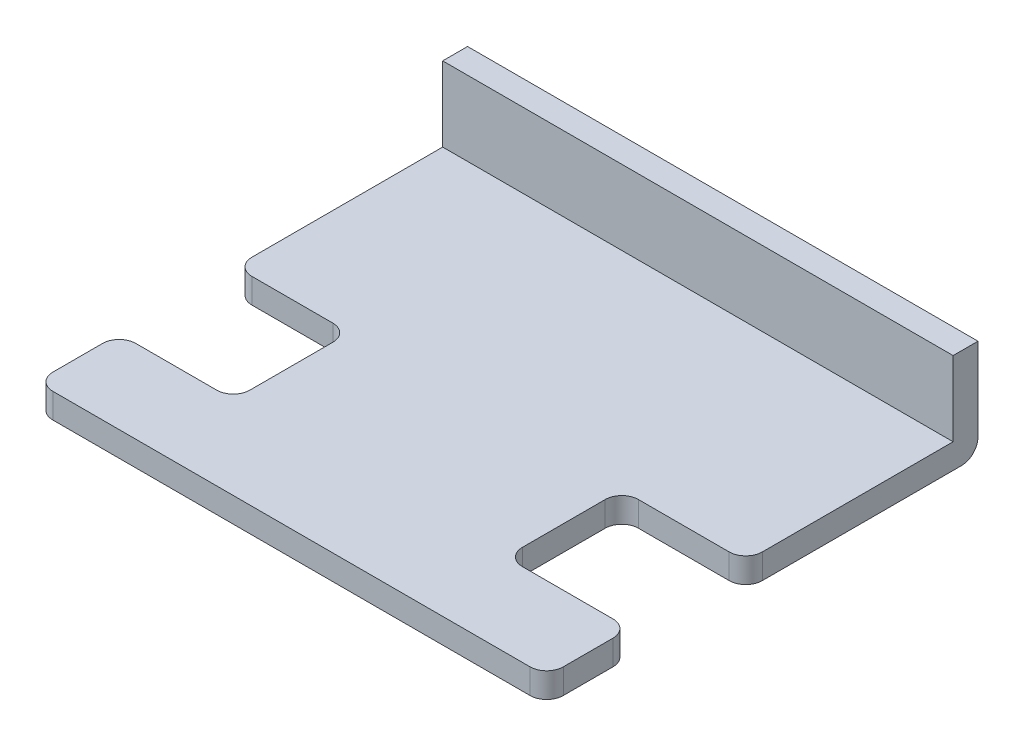
ISO-10303-21;
HEADER;
FILE_DESCRIPTION(('STEP AP214'),'2;1');
FILE_NAME('part.step','',(''),(''),'','','');
FILE_SCHEMA(('AUTOMOTIVE_DESIGN { 1 0 10303 214 1 1 1 1 }'));
ENDSEC;
DATA;
#1=APPLICATION_CONTEXT('core data for automotive mechanical design processes');
#2=APPLICATION_PROTOCOL_DEFINITION('international standard','automotive_design',2000,#1);
#3=PRODUCT_CONTEXT('',#1,'mechanical');
#4=PRODUCT('Part','Part','',(#3));
#5=PRODUCT_RELATED_PRODUCT_CATEGORY('part','',(#4));
#6=PRODUCT_DEFINITION_FORMATION('','',#4);
#7=PRODUCT_DEFINITION_CONTEXT('part definition',#1,'design');
#8=PRODUCT_DEFINITION('design','',#6,#7);
#9=PRODUCT_DEFINITION_SHAPE('','',#8);
#10=(LENGTH_UNIT() NAMED_UNIT(*) SI_UNIT(.MILLI.,.METRE.));
#11=(NAMED_UNIT(*) PLANE_ANGLE_UNIT() SI_UNIT($,.RADIAN.));
#12=(NAMED_UNIT(*) SI_UNIT($,.STERADIAN.) SOLID_ANGLE_UNIT());
#13=UNCERTAINTY_MEASURE_WITH_UNIT(LENGTH_MEASURE(1.E-05),#10,'distance_accuracy_value','');
#14=(GEOMETRIC_REPRESENTATION_CONTEXT(3) GLOBAL_UNCERTAINTY_ASSIGNED_CONTEXT((#13)) GLOBAL_UNIT_ASSIGNED_CONTEXT((#10,
#11,#12)) REPRESENTATION_CONTEXT('',''));
#15=CARTESIAN_POINT('',(0.,0.,0.));
#16=DIRECTION('',(0.,0.,1.));
#17=DIRECTION('',(1.,0.,0.));
#18=AXIS2_PLACEMENT_3D('',#15,#16,#17);
#19=CARTESIAN_POINT('',(0.,2.,-6.21301775147929));
#20=DIRECTION('',(-1.,0.,0.));
#21=DIRECTION('',(0.,0.,1.));
#22=AXIS2_PLACEMENT_3D('',#19,#20,#21);
#23=CYLINDRICAL_SURFACE('',#22,2.);
#24=DIRECTION('',(-1.,0.,0.));
#25=VECTOR('',#24,1.);
#26=CARTESIAN_POINT('',(0.,2.,-8.21301775147929));
#27=LINE('',#26,#25);
#28=CARTESIAN_POINT('',(31.0650887573964,2.,-8.21301775147929));
#29=VERTEX_POINT('',#28);
#30=CARTESIAN_POINT('',(-30.4733727810651,2.,-8.21301775147929));
#31=VERTEX_POINT('',#30);
#32=EDGE_CURVE('E202',#29,#31,#27,.T.);
#33=ORIENTED_EDGE('',*,*,#32,.F.);
#34=CARTESIAN_POINT('',(31.0650887573964,2.,-6.21301775147929));
#35=DIRECTION('',(-1.,0.,0.));
#36=DIRECTION('',(0.,0.,1.));
#37=AXIS2_PLACEMENT_3D('',#34,#35,#36);
#38=CIRCLE('',#37,2.);
#39=CARTESIAN_POINT('',(31.0650887573964,0.,-6.21301775147929));
#40=VERTEX_POINT('',#39);
#41=EDGE_CURVE('E40',#40,#29,#38,.F.);
#42=ORIENTED_EDGE('',*,*,#41,.F.);
#43=DIRECTION('',(-1.,0.,0.));
#44=VECTOR('',#43,1.);
#45=CARTESIAN_POINT('',(-28.4733727810651,0.,-6.21301775147929));
#46=LINE('',#45,#44);
#47=CARTESIAN_POINT('',(-30.4733727810651,0.,-6.21301775147929));
#48=VERTEX_POINT('',#47);
#49=EDGE_CURVE('E293',#48,#40,#46,.F.);
#50=ORIENTED_EDGE('',*,*,#49,.F.);
#51=CARTESIAN_POINT('',(-30.4733727810651,2.,-6.21301775147929));
#52=DIRECTION('',(1.,0.,0.));
#53=DIRECTION('',(0.,0.,-1.));
#54=AXIS2_PLACEMENT_3D('',#51,#52,#53);
#55=CIRCLE('',#54,2.);
#56=EDGE_CURVE('E11',#31,#48,#55,.F.);
#57=ORIENTED_EDGE('',*,*,#56,.F.);
#58=EDGE_LOOP('',(#33,#42,#50,#57));
#59=FACE_BOUND('',#58,.T.);
#60=ADVANCED_FACE('F33',(#59),#23,.T.);
#61=CARTESIAN_POINT('',(-30.4733727810651,3.,-5.21301775147929));
#62=DIRECTION('',(1.,0.,0.));
#63=DIRECTION('',(0.,0.,-1.));
#64=AXIS2_PLACEMENT_3D('',#61,#62,#63);
#65=PLANE('',#64);
#66=DIRECTION('',(0.,1.,0.));
#67=VECTOR('',#66,1.);
#68=CARTESIAN_POINT('',(-30.4733727810651,0.,-8.21301775147929));
#69=LINE('',#68,#67);
#70=CARTESIAN_POINT('',(-30.4733727810651,12.,-8.21301775147929));
#71=VERTEX_POINT('',#70);
#72=EDGE_CURVE('E195',#31,#71,#69,.T.);
#73=ORIENTED_EDGE('',*,*,#72,.F.);
#74=ORIENTED_EDGE('',*,*,#56,.T.);
#75=DIRECTION('',(0.,0.,1.));
#76=VECTOR('',#75,1.);
#77=CARTESIAN_POINT('',(-30.4733727810651,0.,-5.21301775147929));
#78=LINE('',#77,#76);
#79=CARTESIAN_POINT('',(-30.4733727810651,0.,17.7869822485207));
#80=VERTEX_POINT('',#79);
#81=EDGE_CURVE('E212',#48,#80,#78,.T.);
#82=ORIENTED_EDGE('',*,*,#81,.T.);
#83=DIRECTION('',(0.,-1.,0.));
#84=VECTOR('',#83,1.);
#85=CARTESIAN_POINT('',(-30.4733727810651,3.,17.7869822485207));
#86=LINE('',#85,#84);
#87=CARTESIAN_POINT('',(-30.4733727810651,3.,17.7869822485207));
#88=VERTEX_POINT('',#87);
#89=EDGE_CURVE('E281',#88,#80,#86,.T.);
#90=ORIENTED_EDGE('',*,*,#89,.F.);
#91=DIRECTION('',(0.,0.,1.));
#92=VECTOR('',#91,1.);
#93=CARTESIAN_POINT('',(-30.4733727810651,3.,-5.21301775147929));
#94=LINE('',#93,#92);
#95=CARTESIAN_POINT('',(-30.4733727810651,3.,-5.21301775147929));
#96=VERTEX_POINT('',#95);
#97=EDGE_CURVE('E235',#96,#88,#94,.T.);
#98=ORIENTED_EDGE('',*,*,#97,.F.);
#99=DIRECTION('',(0.,1.,0.));
#100=VECTOR('',#99,1.);
#101=CARTESIAN_POINT('',(-30.4733727810651,0.,-5.21301775147929));
#102=LINE('',#101,#100);
#103=CARTESIAN_POINT('',(-30.4733727810651,12.,-5.21301775147929));
#104=VERTEX_POINT('',#103);
#105=EDGE_CURVE('E209',#96,#104,#102,.T.);
#106=ORIENTED_EDGE('',*,*,#105,.T.);
#107=DIRECTION('',(0.,0.,1.));
#108=VECTOR('',#107,1.);
#109=CARTESIAN_POINT('',(-30.4733727810651,12.,-8.21301775147929));
#110=LINE('',#109,#108);
#111=EDGE_CURVE('E206',#71,#104,#110,.T.);
#112=ORIENTED_EDGE('',*,*,#111,.F.);
#113=EDGE_LOOP('',(#73,#74,#82,#90,#98,#106,#112));
#114=FACE_BOUND('',#113,.T.);
#115=ADVANCED_FACE('F207',(#114),#65,.F.);
#116=CARTESIAN_POINT('',(-28.4733727810651,3.,17.7869822485207));
#117=DIRECTION('',(0.,-1.,0.));
#118=DIRECTION('',(0.,0.,-1.));
#119=AXIS2_PLACEMENT_3D('',#116,#117,#118);
#120=CYLINDRICAL_SURFACE('',#119,2.);
#121=CARTESIAN_POINT('',(-28.4733727810651,0.,17.7869822485207));
#122=DIRECTION('',(0.,1.,0.));
#123=DIRECTION('',(0.,0.,1.));
#124=AXIS2_PLACEMENT_3D('',#121,#122,#123);
#125=CIRCLE('',#124,2.);
#126=CARTESIAN_POINT('',(-28.4733727810651,0.,19.7869822485207));
#127=VERTEX_POINT('',#126);
#128=EDGE_CURVE('E405',#80,#127,#125,.T.);
#129=ORIENTED_EDGE('',*,*,#128,.T.);
#130=DIRECTION('',(0.,-1.,0.));
#131=VECTOR('',#130,1.);
#132=CARTESIAN_POINT('',(-28.4733727810651,3.,19.7869822485207));
#133=LINE('',#132,#131);
#134=CARTESIAN_POINT('',(-28.4733727810651,3.,19.7869822485207));
#135=VERTEX_POINT('',#134);
#136=EDGE_CURVE('E310',#135,#127,#133,.T.);
#137=ORIENTED_EDGE('',*,*,#136,.F.);
#138=CARTESIAN_POINT('',(-28.4733727810651,3.,17.7869822485207));
#139=DIRECTION('',(0.,1.,0.));
#140=DIRECTION('',(0.,0.,1.));
#141=AXIS2_PLACEMENT_3D('',#138,#139,#140);
#142=CIRCLE('',#141,2.);
#143=EDGE_CURVE('E232',#88,#135,#142,.T.);
#144=ORIENTED_EDGE('',*,*,#143,.F.);
#145=ORIENTED_EDGE('',*,*,#89,.T.);
#146=EDGE_LOOP('',(#129,#137,#144,#145));
#147=FACE_BOUND('',#146,.T.);
#148=ADVANCED_FACE('F406',(#147),#120,.T.);
#149=CARTESIAN_POINT('',(-28.4733727810651,3.,19.7869822485207));
#150=DIRECTION('',(0.,0.,-1.));
#151=DIRECTION('',(-1.,0.,0.));
#152=AXIS2_PLACEMENT_3D('',#149,#150,#151);
#153=PLANE('',#152);
#154=DIRECTION('',(1.,0.,0.));
#155=VECTOR('',#154,1.);
#156=CARTESIAN_POINT('',(-28.4733727810651,0.,19.7869822485207));
#157=LINE('',#156,#155);
#158=CARTESIAN_POINT('',(-18.715976331361,0.,19.7869822485207));
#159=VERTEX_POINT('',#158);
#160=EDGE_CURVE('E404',#127,#159,#157,.T.);
#161=ORIENTED_EDGE('',*,*,#160,.T.);
#162=DIRECTION('',(0.,-1.,0.));
#163=VECTOR('',#162,1.);
#164=CARTESIAN_POINT('',(-18.715976331361,3.,19.7869822485207));
#165=LINE('',#164,#163);
#166=CARTESIAN_POINT('',(-18.715976331361,3.,19.7869822485207));
#167=VERTEX_POINT('',#166);
#168=EDGE_CURVE('E312',#167,#159,#165,.T.);
#169=ORIENTED_EDGE('',*,*,#168,.F.);
#170=DIRECTION('',(1.,0.,0.));
#171=VECTOR('',#170,1.);
#172=CARTESIAN_POINT('',(-28.4733727810651,3.,19.7869822485207));
#173=LINE('',#172,#171);
#174=EDGE_CURVE('E234',#135,#167,#173,.T.);
#175=ORIENTED_EDGE('',*,*,#174,.F.);
#176=ORIENTED_EDGE('',*,*,#136,.T.);
#177=EDGE_LOOP('',(#161,#169,#175,#176));
#178=FACE_BOUND('',#177,.T.);
#179=ADVANCED_FACE('F412',(#178),#153,.F.);
#180=CARTESIAN_POINT('',(-18.715976331361,3.,21.7869822485207));
#181=DIRECTION('',(0.,-1.,0.));
#182=DIRECTION('',(0.,0.,-1.));
#183=AXIS2_PLACEMENT_3D('',#180,#181,#182);
#184=CYLINDRICAL_SURFACE('',#183,2.);
#185=CARTESIAN_POINT('',(-18.715976331361,0.,21.7869822485207));
#186=DIRECTION('',(0.,-1.,0.));
#187=DIRECTION('',(0.,0.,1.));
#188=AXIS2_PLACEMENT_3D('',#185,#186,#187);
#189=CIRCLE('',#188,2.);
#190=CARTESIAN_POINT('',(-16.715976331361,0.,21.7869822485207));
#191=VERTEX_POINT('',#190);
#192=EDGE_CURVE('E402',#159,#191,#189,.T.);
#193=ORIENTED_EDGE('',*,*,#192,.T.);
#194=DIRECTION('',(0.,-1.,0.));
#195=VECTOR('',#194,1.);
#196=CARTESIAN_POINT('',(-16.715976331361,3.,21.7869822485207));
#197=LINE('',#196,#195);
#198=CARTESIAN_POINT('',(-16.715976331361,3.,21.7869822485207));
#199=VERTEX_POINT('',#198);
#200=EDGE_CURVE('E318',#199,#191,#197,.T.);
#201=ORIENTED_EDGE('',*,*,#200,.F.);
#202=CARTESIAN_POINT('',(-18.715976331361,3.,21.7869822485207));
#203=DIRECTION('',(0.,-1.,0.));
#204=DIRECTION('',(0.,0.,1.));
#205=AXIS2_PLACEMENT_3D('',#202,#203,#204);
#206=CIRCLE('',#205,2.);
#207=EDGE_CURVE('E237',#167,#199,#206,.T.);
#208=ORIENTED_EDGE('',*,*,#207,.F.);
#209=ORIENTED_EDGE('',*,*,#168,.T.);
#210=EDGE_LOOP('',(#193,#201,#208,#209));
#211=FACE_BOUND('',#210,.T.);
#212=ADVANCED_FACE('F415',(#211),#184,.F.);
#213=CARTESIAN_POINT('',(-16.715976331361,3.,21.7869822485207));
#214=DIRECTION('',(1.,0.,0.));
#215=DIRECTION('',(0.,0.,-1.));
#216=AXIS2_PLACEMENT_3D('',#213,#214,#215);
#217=PLANE('',#216);
#218=DIRECTION('',(0.,0.,1.));
#219=VECTOR('',#218,1.);
#220=CARTESIAN_POINT('',(-16.715976331361,0.,21.7869822485207));
#221=LINE('',#220,#219);
#222=CARTESIAN_POINT('',(-16.715976331361,0.,31.7869822485207));
#223=VERTEX_POINT('',#222);
#224=EDGE_CURVE('E400',#191,#223,#221,.T.);
#225=ORIENTED_EDGE('',*,*,#224,.T.);
#226=DIRECTION('',(0.,-1.,0.));
#227=VECTOR('',#226,1.);
#228=CARTESIAN_POINT('',(-16.715976331361,3.,31.7869822485207));
#229=LINE('',#228,#227);
#230=CARTESIAN_POINT('',(-16.715976331361,3.,31.7869822485207));
#231=VERTEX_POINT('',#230);
#232=EDGE_CURVE('E323',#231,#223,#229,.T.);
#233=ORIENTED_EDGE('',*,*,#232,.F.);
#234=DIRECTION('',(0.,0.,1.));
#235=VECTOR('',#234,1.);
#236=CARTESIAN_POINT('',(-16.715976331361,3.,21.7869822485207));
#237=LINE('',#236,#235);
#238=EDGE_CURVE('E239',#199,#231,#237,.T.);
#239=ORIENTED_EDGE('',*,*,#238,.F.);
#240=ORIENTED_EDGE('',*,*,#200,.T.);
#241=EDGE_LOOP('',(#225,#233,#239,#240));
#242=FACE_BOUND('',#241,.T.);
#243=ADVANCED_FACE('F422',(#242),#217,.F.);
#244=CARTESIAN_POINT('',(-18.715976331361,3.,31.7869822485207));
#245=DIRECTION('',(0.,-1.,0.));
#246=DIRECTION('',(0.,0.,-1.));
#247=AXIS2_PLACEMENT_3D('',#244,#245,#246);
#248=CYLINDRICAL_SURFACE('',#247,2.);
#249=CARTESIAN_POINT('',(-18.715976331361,0.,31.7869822485207));
#250=DIRECTION('',(0.,-1.,0.));
#251=DIRECTION('',(0.,0.,1.));
#252=AXIS2_PLACEMENT_3D('',#249,#250,#251);
#253=CIRCLE('',#252,2.);
#254=CARTESIAN_POINT('',(-18.715976331361,0.,33.7869822485207));
#255=VERTEX_POINT('',#254);
#256=EDGE_CURVE('E398',#223,#255,#253,.T.);
#257=ORIENTED_EDGE('',*,*,#256,.T.);
#258=DIRECTION('',(0.,-1.,0.));
#259=VECTOR('',#258,1.);
#260=CARTESIAN_POINT('',(-18.715976331361,3.,33.7869822485207));
#261=LINE('',#260,#259);
#262=CARTESIAN_POINT('',(-18.715976331361,3.,33.7869822485207));
#263=VERTEX_POINT('',#262);
#264=EDGE_CURVE('E326',#263,#255,#261,.T.);
#265=ORIENTED_EDGE('',*,*,#264,.F.);
#266=CARTESIAN_POINT('',(-18.715976331361,3.,31.7869822485207));
#267=DIRECTION('',(0.,-1.,0.));
#268=DIRECTION('',(0.,0.,1.));
#269=AXIS2_PLACEMENT_3D('',#266,#267,#268);
#270=CIRCLE('',#269,2.);
#271=EDGE_CURVE('E241',#231,#263,#270,.T.);
#272=ORIENTED_EDGE('',*,*,#271,.F.);
#273=ORIENTED_EDGE('',*,*,#232,.T.);
#274=EDGE_LOOP('',(#257,#265,#272,#273));
#275=FACE_BOUND('',#274,.T.);
#276=ADVANCED_FACE('F425',(#275),#248,.F.);
#277=CARTESIAN_POINT('',(-28.4733727810651,3.,33.7869822485207));
#278=DIRECTION('',(0.,0.,1.));
#279=DIRECTION('',(1.,0.,0.));
#280=AXIS2_PLACEMENT_3D('',#277,#278,#279);
#281=PLANE('',#280);
#282=DIRECTION('',(-1.,0.,0.));
#283=VECTOR('',#282,1.);
#284=CARTESIAN_POINT('',(-28.4733727810651,0.,33.7869822485207));
#285=LINE('',#284,#283);
#286=CARTESIAN_POINT('',(-28.4733727810651,0.,33.7869822485207));
#287=VERTEX_POINT('',#286);
#288=EDGE_CURVE('E396',#255,#287,#285,.T.);
#289=ORIENTED_EDGE('',*,*,#288,.T.);
#290=DIRECTION('',(0.,-1.,0.));
#291=VECTOR('',#290,1.);
#292=CARTESIAN_POINT('',(-28.4733727810651,3.,33.7869822485207));
#293=LINE('',#292,#291);
#294=CARTESIAN_POINT('',(-28.4733727810651,3.,33.7869822485207));
#295=VERTEX_POINT('',#294);
#296=EDGE_CURVE('E329',#295,#287,#293,.T.);
#297=ORIENTED_EDGE('',*,*,#296,.F.);
#298=DIRECTION('',(-1.,0.,0.));
#299=VECTOR('',#298,1.);
#300=CARTESIAN_POINT('',(-28.4733727810651,3.,33.7869822485207));
#301=LINE('',#300,#299);
#302=EDGE_CURVE('E243',#263,#295,#301,.T.);
#303=ORIENTED_EDGE('',*,*,#302,.F.);
#304=ORIENTED_EDGE('',*,*,#264,.T.);
#305=EDGE_LOOP('',(#289,#297,#303,#304));
#306=FACE_BOUND('',#305,.T.);
#307=ADVANCED_FACE('F430',(#306),#281,.F.);
#308=CARTESIAN_POINT('',(-28.4733727810651,3.,35.7869822485207));
#309=DIRECTION('',(0.,-1.,0.));
#310=DIRECTION('',(0.,0.,-1.));
#311=AXIS2_PLACEMENT_3D('',#308,#309,#310);
#312=CYLINDRICAL_SURFACE('',#311,2.);
#313=CARTESIAN_POINT('',(-28.4733727810651,0.,35.7869822485207));
#314=DIRECTION('',(0.,1.,0.));
#315=DIRECTION('',(0.,0.,1.));
#316=AXIS2_PLACEMENT_3D('',#313,#314,#315);
#317=CIRCLE('',#316,2.);
#318=CARTESIAN_POINT('',(-30.4733727810651,0.,35.7869822485207));
#319=VERTEX_POINT('',#318);
#320=EDGE_CURVE('E394',#287,#319,#317,.T.);
#321=ORIENTED_EDGE('',*,*,#320,.T.);
#322=DIRECTION('',(0.,-1.,0.));
#323=VECTOR('',#322,1.);
#324=CARTESIAN_POINT('',(-30.4733727810651,3.,35.7869822485207));
#325=LINE('',#324,#323);
#326=CARTESIAN_POINT('',(-30.4733727810651,3.,35.7869822485207));
#327=VERTEX_POINT('',#326);
#328=EDGE_CURVE('E332',#327,#319,#325,.T.);
#329=ORIENTED_EDGE('',*,*,#328,.F.);
#330=CARTESIAN_POINT('',(-28.4733727810651,3.,35.7869822485207));
#331=DIRECTION('',(0.,1.,0.));
#332=DIRECTION('',(0.,0.,1.));
#333=AXIS2_PLACEMENT_3D('',#330,#331,#332);
#334=CIRCLE('',#333,2.);
#335=EDGE_CURVE('E245',#295,#327,#334,.T.);
#336=ORIENTED_EDGE('',*,*,#335,.F.);
#337=ORIENTED_EDGE('',*,*,#296,.T.);
#338=EDGE_LOOP('',(#321,#329,#336,#337));
#339=FACE_BOUND('',#338,.T.);
#340=ADVANCED_FACE('F436',(#339),#312,.T.);
#341=CARTESIAN_POINT('',(-30.4733727810651,3.,35.7869822485207));
#342=DIRECTION('',(1.,0.,0.));
#343=DIRECTION('',(0.,0.,-1.));
#344=AXIS2_PLACEMENT_3D('',#341,#342,#343);
#345=PLANE('',#344);
#346=DIRECTION('',(0.,0.,1.));
#347=VECTOR('',#346,1.);
#348=CARTESIAN_POINT('',(-30.4733727810651,0.,35.7869822485207));
#349=LINE('',#348,#347);
#350=CARTESIAN_POINT('',(-30.4733727810651,0.,41.7869822485207));
#351=VERTEX_POINT('',#350);
#352=EDGE_CURVE('E392',#319,#351,#349,.T.);
#353=ORIENTED_EDGE('',*,*,#352,.T.);
#354=DIRECTION('',(0.,-1.,0.));
#355=VECTOR('',#354,1.);
#356=CARTESIAN_POINT('',(-30.4733727810651,3.,41.7869822485207));
#357=LINE('',#356,#355);
#358=CARTESIAN_POINT('',(-30.4733727810651,3.,41.7869822485207));
#359=VERTEX_POINT('',#358);
#360=EDGE_CURVE('E335',#359,#351,#357,.T.);
#361=ORIENTED_EDGE('',*,*,#360,.F.);
#362=DIRECTION('',(0.,0.,1.));
#363=VECTOR('',#362,1.);
#364=CARTESIAN_POINT('',(-30.4733727810651,3.,35.7869822485207));
#365=LINE('',#364,#363);
#366=EDGE_CURVE('E247',#327,#359,#365,.T.);
#367=ORIENTED_EDGE('',*,*,#366,.F.);
#368=ORIENTED_EDGE('',*,*,#328,.T.);
#369=EDGE_LOOP('',(#353,#361,#367,#368));
#370=FACE_BOUND('',#369,.T.);
#371=ADVANCED_FACE('F440',(#370),#345,.F.);
#372=CARTESIAN_POINT('',(-28.4733727810651,3.,41.7869822485207));
#373=DIRECTION('',(0.,-1.,0.));
#374=DIRECTION('',(0.,0.,-1.));
#375=AXIS2_PLACEMENT_3D('',#372,#373,#374);
#376=CYLINDRICAL_SURFACE('',#375,2.);
#377=CARTESIAN_POINT('',(-28.4733727810651,0.,41.7869822485207));
#378=DIRECTION('',(0.,1.,0.));
#379=DIRECTION('',(0.,0.,1.));
#380=AXIS2_PLACEMENT_3D('',#377,#378,#379);
#381=CIRCLE('',#380,2.);
#382=CARTESIAN_POINT('',(-28.4733727810651,0.,43.7869822485207));
#383=VERTEX_POINT('',#382);
#384=EDGE_CURVE('E390',#351,#383,#381,.T.);
#385=ORIENTED_EDGE('',*,*,#384,.T.);
#386=DIRECTION('',(0.,-1.,0.));
#387=VECTOR('',#386,1.);
#388=CARTESIAN_POINT('',(-28.4733727810651,3.,43.7869822485207));
#389=LINE('',#388,#387);
#390=CARTESIAN_POINT('',(-28.4733727810651,3.,43.7869822485207));
#391=VERTEX_POINT('',#390);
#392=EDGE_CURVE('E338',#391,#383,#389,.T.);
#393=ORIENTED_EDGE('',*,*,#392,.F.);
#394=CARTESIAN_POINT('',(-28.4733727810651,3.,41.7869822485207));
#395=DIRECTION('',(0.,1.,0.));
#396=DIRECTION('',(0.,0.,1.));
#397=AXIS2_PLACEMENT_3D('',#394,#395,#396);
#398=CIRCLE('',#397,2.);
#399=EDGE_CURVE('E249',#359,#391,#398,.T.);
#400=ORIENTED_EDGE('',*,*,#399,.F.);
#401=ORIENTED_EDGE('',*,*,#360,.T.);
#402=EDGE_LOOP('',(#385,#393,#400,#401));
#403=FACE_BOUND('',#402,.T.);
#404=ADVANCED_FACE('F445',(#403),#376,.T.);
#405=CARTESIAN_POINT('',(-28.4733727810651,3.,43.7869822485207));
#406=DIRECTION('',(0.,0.,-1.));
#407=DIRECTION('',(-1.,0.,0.));
#408=AXIS2_PLACEMENT_3D('',#405,#406,#407);
#409=PLANE('',#408);
#410=DIRECTION('',(1.,0.,0.));
#411=VECTOR('',#410,1.);
#412=CARTESIAN_POINT('',(-28.4733727810651,0.,43.7869822485207));
#413=LINE('',#412,#411);
#414=CARTESIAN_POINT('',(29.0650887573964,0.,43.7869822485207));
#415=VERTEX_POINT('',#414);
#416=EDGE_CURVE('E388',#383,#415,#413,.T.);
#417=ORIENTED_EDGE('',*,*,#416,.T.);
#418=DIRECTION('',(0.,-1.,0.));
#419=VECTOR('',#418,1.);
#420=CARTESIAN_POINT('',(29.0650887573964,3.,43.7869822485207));
#421=LINE('',#420,#419);
#422=CARTESIAN_POINT('',(29.0650887573964,3.,43.7869822485207));
#423=VERTEX_POINT('',#422);
#424=EDGE_CURVE('E341',#423,#415,#421,.T.);
#425=ORIENTED_EDGE('',*,*,#424,.F.);
#426=DIRECTION('',(1.,0.,0.));
#427=VECTOR('',#426,1.);
#428=CARTESIAN_POINT('',(-28.4733727810651,3.,43.7869822485207));
#429=LINE('',#428,#427);
#430=EDGE_CURVE('E251',#391,#423,#429,.T.);
#431=ORIENTED_EDGE('',*,*,#430,.F.);
#432=ORIENTED_EDGE('',*,*,#392,.T.);
#433=EDGE_LOOP('',(#417,#425,#431,#432));
#434=FACE_BOUND('',#433,.T.);
#435=ADVANCED_FACE('F451',(#434),#409,.F.);
#436=CARTESIAN_POINT('',(29.0650887573964,3.,41.7869822485207));
#437=DIRECTION('',(0.,-1.,0.));
#438=DIRECTION('',(0.,0.,-1.));
#439=AXIS2_PLACEMENT_3D('',#436,#437,#438);
#440=CYLINDRICAL_SURFACE('',#439,2.);
#441=CARTESIAN_POINT('',(29.0650887573964,0.,41.7869822485207));
#442=DIRECTION('',(0.,1.,0.));
#443=DIRECTION('',(0.,0.,1.));
#444=AXIS2_PLACEMENT_3D('',#441,#442,#443);
#445=CIRCLE('',#444,2.);
#446=CARTESIAN_POINT('',(31.0650887573964,0.,41.7869822485207));
#447=VERTEX_POINT('',#446);
#448=EDGE_CURVE('E386',#415,#447,#445,.T.);
#449=ORIENTED_EDGE('',*,*,#448,.T.);
#450=DIRECTION('',(0.,-1.,0.));
#451=VECTOR('',#450,1.);
#452=CARTESIAN_POINT('',(31.0650887573964,3.,41.7869822485207));
#453=LINE('',#452,#451);
#454=CARTESIAN_POINT('',(31.0650887573964,3.,41.7869822485207));
#455=VERTEX_POINT('',#454);
#456=EDGE_CURVE('E344',#455,#447,#453,.T.);
#457=ORIENTED_EDGE('',*,*,#456,.F.);
#458=CARTESIAN_POINT('',(29.0650887573964,3.,41.7869822485207));
#459=DIRECTION('',(0.,1.,0.));
#460=DIRECTION('',(0.,0.,1.));
#461=AXIS2_PLACEMENT_3D('',#458,#459,#460);
#462=CIRCLE('',#461,2.);
#463=EDGE_CURVE('E253',#423,#455,#462,.T.);
#464=ORIENTED_EDGE('',*,*,#463,.F.);
#465=ORIENTED_EDGE('',*,*,#424,.T.);
#466=EDGE_LOOP('',(#449,#457,#464,#465));
#467=FACE_BOUND('',#466,.T.);
#468=ADVANCED_FACE('F455',(#467),#440,.T.);
#469=CARTESIAN_POINT('',(31.0650887573964,3.,35.7869822485207));
#470=DIRECTION('',(-1.,0.,0.));
#471=DIRECTION('',(0.,0.,1.));
#472=AXIS2_PLACEMENT_3D('',#469,#470,#471);
#473=PLANE('',#472);
#474=DIRECTION('',(0.,0.,-1.));
#475=VECTOR('',#474,1.);
#476=CARTESIAN_POINT('',(31.0650887573964,0.,35.7869822485207));
#477=LINE('',#476,#475);
#478=CARTESIAN_POINT('',(31.0650887573964,0.,35.7869822485207));
#479=VERTEX_POINT('',#478);
#480=EDGE_CURVE('E384',#447,#479,#477,.T.);
#481=ORIENTED_EDGE('',*,*,#480,.T.);
#482=DIRECTION('',(0.,-1.,0.));
#483=VECTOR('',#482,1.);
#484=CARTESIAN_POINT('',(31.0650887573964,3.,35.7869822485207));
#485=LINE('',#484,#483);
#486=CARTESIAN_POINT('',(31.0650887573964,3.,35.7869822485207));
#487=VERTEX_POINT('',#486);
#488=EDGE_CURVE('E347',#487,#479,#485,.T.);
#489=ORIENTED_EDGE('',*,*,#488,.F.);
#490=DIRECTION('',(0.,0.,-1.));
#491=VECTOR('',#490,1.);
#492=CARTESIAN_POINT('',(31.0650887573964,3.,35.7869822485207));
#493=LINE('',#492,#491);
#494=EDGE_CURVE('E255',#455,#487,#493,.T.);
#495=ORIENTED_EDGE('',*,*,#494,.F.);
#496=ORIENTED_EDGE('',*,*,#456,.T.);
#497=EDGE_LOOP('',(#481,#489,#495,#496));
#498=FACE_BOUND('',#497,.T.);
#499=ADVANCED_FACE('F460',(#498),#473,.F.);
#500=CARTESIAN_POINT('',(29.0650887573964,3.,35.7869822485207));
#501=DIRECTION('',(0.,-1.,0.));
#502=DIRECTION('',(0.,0.,-1.));
#503=AXIS2_PLACEMENT_3D('',#500,#501,#502);
#504=CYLINDRICAL_SURFACE('',#503,2.);
#505=CARTESIAN_POINT('',(29.0650887573964,0.,35.7869822485207));
#506=DIRECTION('',(0.,1.,0.));
#507=DIRECTION('',(0.,0.,-1.));
#508=AXIS2_PLACEMENT_3D('',#505,#506,#507);
#509=CIRCLE('',#508,2.);
#510=CARTESIAN_POINT('',(29.0650887573964,0.,33.7869822485207));
#511=VERTEX_POINT('',#510);
#512=EDGE_CURVE('E382',#479,#511,#509,.T.);
#513=ORIENTED_EDGE('',*,*,#512,.T.);
#514=DIRECTION('',(0.,-1.,0.));
#515=VECTOR('',#514,1.);
#516=CARTESIAN_POINT('',(29.0650887573964,3.,33.7869822485207));
#517=LINE('',#516,#515);
#518=CARTESIAN_POINT('',(29.0650887573964,3.,33.7869822485207));
#519=VERTEX_POINT('',#518);
#520=EDGE_CURVE('E350',#519,#511,#517,.T.);
#521=ORIENTED_EDGE('',*,*,#520,.F.);
#522=CARTESIAN_POINT('',(29.0650887573964,3.,35.7869822485207));
#523=DIRECTION('',(0.,1.,0.));
#524=DIRECTION('',(0.,0.,-1.));
#525=AXIS2_PLACEMENT_3D('',#522,#523,#524);
#526=CIRCLE('',#525,2.);
#527=EDGE_CURVE('E257',#487,#519,#526,.T.);
#528=ORIENTED_EDGE('',*,*,#527,.F.);
#529=ORIENTED_EDGE('',*,*,#488,.T.);
#530=EDGE_LOOP('',(#513,#521,#528,#529));
#531=FACE_BOUND('',#530,.T.);
#532=ADVANCED_FACE('F466',(#531),#504,.T.);
#533=CARTESIAN_POINT('',(18.1242603550296,3.,33.7869822485207));
#534=DIRECTION('',(0.,0.,1.));
#535=DIRECTION('',(1.,0.,0.));
#536=AXIS2_PLACEMENT_3D('',#533,#534,#535);
#537=PLANE('',#536);
#538=DIRECTION('',(-1.,0.,0.));
#539=VECTOR('',#538,1.);
#540=CARTESIAN_POINT('',(18.1242603550296,0.,33.7869822485207));
#541=LINE('',#540,#539);
#542=CARTESIAN_POINT('',(18.1242603550296,0.,33.7869822485207));
#543=VERTEX_POINT('',#542);
#544=EDGE_CURVE('E380',#511,#543,#541,.T.);
#545=ORIENTED_EDGE('',*,*,#544,.T.);
#546=DIRECTION('',(0.,-1.,0.));
#547=VECTOR('',#546,1.);
#548=CARTESIAN_POINT('',(18.1242603550296,3.,33.7869822485207));
#549=LINE('',#548,#547);
#550=CARTESIAN_POINT('',(18.1242603550296,3.,33.7869822485207));
#551=VERTEX_POINT('',#550);
#552=EDGE_CURVE('E353',#551,#543,#549,.T.);
#553=ORIENTED_EDGE('',*,*,#552,.F.);
#554=DIRECTION('',(-1.,0.,0.));
#555=VECTOR('',#554,1.);
#556=CARTESIAN_POINT('',(18.1242603550296,3.,33.7869822485207));
#557=LINE('',#556,#555);
#558=EDGE_CURVE('E259',#519,#551,#557,.T.);
#559=ORIENTED_EDGE('',*,*,#558,.F.);
#560=ORIENTED_EDGE('',*,*,#520,.T.);
#561=EDGE_LOOP('',(#545,#553,#559,#560));
#562=FACE_BOUND('',#561,.T.);
#563=ADVANCED_FACE('F470',(#562),#537,.F.);
#564=CARTESIAN_POINT('',(18.1242603550296,3.,31.7869822485207));
#565=DIRECTION('',(0.,-1.,0.));
#566=DIRECTION('',(0.,0.,-1.));
#567=AXIS2_PLACEMENT_3D('',#564,#565,#566);
#568=CYLINDRICAL_SURFACE('',#567,2.);
#569=CARTESIAN_POINT('',(18.1242603550296,0.,31.7869822485207));
#570=DIRECTION('',(0.,-1.,0.));
#571=DIRECTION('',(0.,0.,-1.));
#572=AXIS2_PLACEMENT_3D('',#569,#570,#571);
#573=CIRCLE('',#572,2.);
#574=CARTESIAN_POINT('',(16.1242603550296,0.,31.7869822485207));
#575=VERTEX_POINT('',#574);
#576=EDGE_CURVE('E378',#543,#575,#573,.T.);
#577=ORIENTED_EDGE('',*,*,#576,.T.);
#578=DIRECTION('',(0.,-1.,0.));
#579=VECTOR('',#578,1.);
#580=CARTESIAN_POINT('',(16.1242603550296,3.,31.7869822485207));
#581=LINE('',#580,#579);
#582=CARTESIAN_POINT('',(16.1242603550296,3.,31.7869822485207));
#583=VERTEX_POINT('',#582);
#584=EDGE_CURVE('E356',#583,#575,#581,.T.);
#585=ORIENTED_EDGE('',*,*,#584,.F.);
#586=CARTESIAN_POINT('',(18.1242603550296,3.,31.7869822485207));
#587=DIRECTION('',(0.,-1.,0.));
#588=DIRECTION('',(0.,0.,-1.));
#589=AXIS2_PLACEMENT_3D('',#586,#587,#588);
#590=CIRCLE('',#589,2.);
#591=EDGE_CURVE('E261',#551,#583,#590,.T.);
#592=ORIENTED_EDGE('',*,*,#591,.F.);
#593=ORIENTED_EDGE('',*,*,#552,.T.);
#594=EDGE_LOOP('',(#577,#585,#592,#593));
#595=FACE_BOUND('',#594,.T.);
#596=ADVANCED_FACE('F475',(#595),#568,.F.);
#597=CARTESIAN_POINT('',(16.1242603550296,3.,21.7869822485207));
#598=DIRECTION('',(-1.,0.,0.));
#599=DIRECTION('',(0.,0.,1.));
#600=AXIS2_PLACEMENT_3D('',#597,#598,#599);
#601=PLANE('',#600);
#602=DIRECTION('',(0.,0.,-1.));
#603=VECTOR('',#602,1.);
#604=CARTESIAN_POINT('',(16.1242603550296,0.,21.7869822485207));
#605=LINE('',#604,#603);
#606=CARTESIAN_POINT('',(16.1242603550296,0.,21.7869822485207));
#607=VERTEX_POINT('',#606);
#608=EDGE_CURVE('E376',#575,#607,#605,.T.);
#609=ORIENTED_EDGE('',*,*,#608,.T.);
#610=DIRECTION('',(0.,-1.,0.));
#611=VECTOR('',#610,1.);
#612=CARTESIAN_POINT('',(16.1242603550296,3.,21.7869822485207));
#613=LINE('',#612,#611);
#614=CARTESIAN_POINT('',(16.1242603550296,3.,21.7869822485207));
#615=VERTEX_POINT('',#614);
#616=EDGE_CURVE('E359',#615,#607,#613,.T.);
#617=ORIENTED_EDGE('',*,*,#616,.F.);
#618=DIRECTION('',(0.,0.,-1.));
#619=VECTOR('',#618,1.);
#620=CARTESIAN_POINT('',(16.1242603550296,3.,21.7869822485207));
#621=LINE('',#620,#619);
#622=EDGE_CURVE('E263',#583,#615,#621,.T.);
#623=ORIENTED_EDGE('',*,*,#622,.F.);
#624=ORIENTED_EDGE('',*,*,#584,.T.);
#625=EDGE_LOOP('',(#609,#617,#623,#624));
#626=FACE_BOUND('',#625,.T.);
#627=ADVANCED_FACE('F481',(#626),#601,.F.);
#628=CARTESIAN_POINT('',(18.1242603550296,3.,21.7869822485207));
#629=DIRECTION('',(0.,-1.,0.));
#630=DIRECTION('',(0.,0.,-1.));
#631=AXIS2_PLACEMENT_3D('',#628,#629,#630);
#632=CYLINDRICAL_SURFACE('',#631,2.);
#633=CARTESIAN_POINT('',(18.1242603550296,0.,21.7869822485207));
#634=DIRECTION('',(0.,-1.,0.));
#635=DIRECTION('',(0.,0.,-1.));
#636=AXIS2_PLACEMENT_3D('',#633,#634,#635);
#637=CIRCLE('',#636,2.);
#638=CARTESIAN_POINT('',(18.1242603550296,0.,19.7869822485207));
#639=VERTEX_POINT('',#638);
#640=EDGE_CURVE('E374',#607,#639,#637,.T.);
#641=ORIENTED_EDGE('',*,*,#640,.T.);
#642=DIRECTION('',(0.,-1.,0.));
#643=VECTOR('',#642,1.);
#644=CARTESIAN_POINT('',(18.1242603550296,3.,19.7869822485207));
#645=LINE('',#644,#643);
#646=CARTESIAN_POINT('',(18.1242603550296,3.,19.7869822485207));
#647=VERTEX_POINT('',#646);
#648=EDGE_CURVE('E362',#647,#639,#645,.T.);
#649=ORIENTED_EDGE('',*,*,#648,.F.);
#650=CARTESIAN_POINT('',(18.1242603550296,3.,21.7869822485207));
#651=DIRECTION('',(0.,-1.,0.));
#652=DIRECTION('',(0.,0.,-1.));
#653=AXIS2_PLACEMENT_3D('',#650,#651,#652);
#654=CIRCLE('',#653,2.);
#655=EDGE_CURVE('E265',#615,#647,#654,.T.);
#656=ORIENTED_EDGE('',*,*,#655,.F.);
#657=ORIENTED_EDGE('',*,*,#616,.T.);
#658=EDGE_LOOP('',(#641,#649,#656,#657));
#659=FACE_BOUND('',#658,.T.);
#660=ADVANCED_FACE('F485',(#659),#632,.F.);
#661=CARTESIAN_POINT('',(18.1242603550296,3.,19.7869822485207));
#662=DIRECTION('',(0.,0.,-1.));
#663=DIRECTION('',(-1.,0.,0.));
#664=AXIS2_PLACEMENT_3D('',#661,#662,#663);
#665=PLANE('',#664);
#666=DIRECTION('',(1.,0.,0.));
#667=VECTOR('',#666,1.);
#668=CARTESIAN_POINT('',(18.1242603550296,0.,19.7869822485207));
#669=LINE('',#668,#667);
#670=CARTESIAN_POINT('',(29.0650887573964,0.,19.7869822485207));
#671=VERTEX_POINT('',#670);
#672=EDGE_CURVE('E372',#639,#671,#669,.T.);
#673=ORIENTED_EDGE('',*,*,#672,.T.);
#674=DIRECTION('',(0.,-1.,0.));
#675=VECTOR('',#674,1.);
#676=CARTESIAN_POINT('',(29.0650887573964,3.,19.7869822485207));
#677=LINE('',#676,#675);
#678=CARTESIAN_POINT('',(29.0650887573964,3.,19.7869822485207));
#679=VERTEX_POINT('',#678);
#680=EDGE_CURVE('E365',#679,#671,#677,.T.);
#681=ORIENTED_EDGE('',*,*,#680,.F.);
#682=DIRECTION('',(1.,0.,0.));
#683=VECTOR('',#682,1.);
#684=CARTESIAN_POINT('',(18.1242603550296,3.,19.7869822485207));
#685=LINE('',#684,#683);
#686=EDGE_CURVE('E267',#647,#679,#685,.T.);
#687=ORIENTED_EDGE('',*,*,#686,.F.);
#688=ORIENTED_EDGE('',*,*,#648,.T.);
#689=EDGE_LOOP('',(#673,#681,#687,#688));
#690=FACE_BOUND('',#689,.T.);
#691=ADVANCED_FACE('F490',(#690),#665,.F.);
#692=CARTESIAN_POINT('',(29.0650887573964,3.,17.7869822485207));
#693=DIRECTION('',(0.,-1.,0.));
#694=DIRECTION('',(0.,0.,-1.));
#695=AXIS2_PLACEMENT_3D('',#692,#693,#694);
#696=CYLINDRICAL_SURFACE('',#695,2.);
#697=CARTESIAN_POINT('',(29.0650887573964,0.,17.7869822485207));
#698=DIRECTION('',(0.,1.,0.));
#699=DIRECTION('',(0.,0.,1.));
#700=AXIS2_PLACEMENT_3D('',#697,#698,#699);
#701=CIRCLE('',#700,2.);
#702=CARTESIAN_POINT('',(31.0650887573964,0.,17.7869822485207));
#703=VERTEX_POINT('',#702);
#704=EDGE_CURVE('E370',#671,#703,#701,.T.);
#705=ORIENTED_EDGE('',*,*,#704,.T.);
#706=DIRECTION('',(0.,-1.,0.));
#707=VECTOR('',#706,1.);
#708=CARTESIAN_POINT('',(31.0650887573964,3.,17.7869822485207));
#709=LINE('',#708,#707);
#710=CARTESIAN_POINT('',(31.0650887573964,3.,17.7869822485207));
#711=VERTEX_POINT('',#710);
#712=EDGE_CURVE('E280',#711,#703,#709,.T.);
#713=ORIENTED_EDGE('',*,*,#712,.F.);
#714=CARTESIAN_POINT('',(29.0650887573964,3.,17.7869822485207));
#715=DIRECTION('',(0.,1.,0.));
#716=DIRECTION('',(0.,0.,1.));
#717=AXIS2_PLACEMENT_3D('',#714,#715,#716);
#718=CIRCLE('',#717,2.);
#719=EDGE_CURVE('E269',#679,#711,#718,.T.);
#720=ORIENTED_EDGE('',*,*,#719,.F.);
#721=ORIENTED_EDGE('',*,*,#680,.T.);
#722=EDGE_LOOP('',(#705,#713,#720,#721));
#723=FACE_BOUND('',#722,.T.);
#724=ADVANCED_FACE('F494',(#723),#696,.T.);
#725=CARTESIAN_POINT('',(31.0650887573964,3.,-5.21301775147929));
#726=DIRECTION('',(-1.,0.,0.));
#727=DIRECTION('',(0.,0.,1.));
#728=AXIS2_PLACEMENT_3D('',#725,#726,#727);
#729=PLANE('',#728);
#730=DIRECTION('',(0.,0.,-1.));
#731=VECTOR('',#730,1.);
#732=CARTESIAN_POINT('',(31.0650887573964,0.,-5.21301775147929));
#733=LINE('',#732,#731);
#734=EDGE_CURVE('E285',#703,#40,#733,.T.);
#735=ORIENTED_EDGE('',*,*,#734,.T.);
#736=ORIENTED_EDGE('',*,*,#41,.T.);
#737=DIRECTION('',(0.,-1.,0.));
#738=VECTOR('',#737,1.);
#739=CARTESIAN_POINT('',(31.0650887573964,0.,-8.21301775147929));
#740=LINE('',#739,#738);
#741=CARTESIAN_POINT('',(31.0650887573964,12.,-8.21301775147929));
#742=VERTEX_POINT('',#741);
#743=EDGE_CURVE('E203',#742,#29,#740,.T.);
#744=ORIENTED_EDGE('',*,*,#743,.F.);
#745=DIRECTION('',(0.,0.,1.));
#746=VECTOR('',#745,1.);
#747=CARTESIAN_POINT('',(31.0650887573964,12.,-8.21301775147929));
#748=LINE('',#747,#746);
#749=CARTESIAN_POINT('',(31.0650887573964,12.,-5.21301775147929));
#750=VERTEX_POINT('',#749);
#751=EDGE_CURVE('E213',#742,#750,#748,.T.);
#752=ORIENTED_EDGE('',*,*,#751,.T.);
#753=DIRECTION('',(0.,-1.,0.));
#754=VECTOR('',#753,1.);
#755=CARTESIAN_POINT('',(31.0650887573964,0.,-5.21301775147929));
#756=LINE('',#755,#754);
#757=CARTESIAN_POINT('',(31.0650887573964,3.,-5.21301775147929));
#758=VERTEX_POINT('',#757);
#759=EDGE_CURVE('E227',#750,#758,#756,.T.);
#760=ORIENTED_EDGE('',*,*,#759,.T.);
#761=DIRECTION('',(0.,0.,-1.));
#762=VECTOR('',#761,1.);
#763=CARTESIAN_POINT('',(31.0650887573964,3.,-5.21301775147929));
#764=LINE('',#763,#762);
#765=EDGE_CURVE('E271',#711,#758,#764,.T.);
#766=ORIENTED_EDGE('',*,*,#765,.F.);
#767=ORIENTED_EDGE('',*,*,#712,.T.);
#768=EDGE_LOOP('',(#735,#736,#744,#752,#760,#766,#767));
#769=FACE_BOUND('',#768,.T.);
#770=ADVANCED_FACE('F296',(#769),#729,.F.);
#771=CARTESIAN_POINT('',(-28.4733727810651,3.,17.7869822485207));
#772=DIRECTION('',(0.,1.,0.));
#773=DIRECTION('',(0.,0.,1.));
#774=AXIS2_PLACEMENT_3D('',#771,#772,#773);
#775=PLANE('',#774);
#776=ORIENTED_EDGE('',*,*,#97,.T.);
#777=ORIENTED_EDGE('',*,*,#143,.T.);
#778=ORIENTED_EDGE('',*,*,#174,.T.);
#779=ORIENTED_EDGE('',*,*,#207,.T.);
#780=ORIENTED_EDGE('',*,*,#238,.T.);
#781=ORIENTED_EDGE('',*,*,#271,.T.);
#782=ORIENTED_EDGE('',*,*,#302,.T.);
#783=ORIENTED_EDGE('',*,*,#335,.T.);
#784=ORIENTED_EDGE('',*,*,#366,.T.);
#785=ORIENTED_EDGE('',*,*,#399,.T.);
#786=ORIENTED_EDGE('',*,*,#430,.T.);
#787=ORIENTED_EDGE('',*,*,#463,.T.);
#788=ORIENTED_EDGE('',*,*,#494,.T.);
#789=ORIENTED_EDGE('',*,*,#527,.T.);
#790=ORIENTED_EDGE('',*,*,#558,.T.);
#791=ORIENTED_EDGE('',*,*,#591,.T.);
#792=ORIENTED_EDGE('',*,*,#622,.T.);
#793=ORIENTED_EDGE('',*,*,#655,.T.);
#794=ORIENTED_EDGE('',*,*,#686,.T.);
#795=ORIENTED_EDGE('',*,*,#719,.T.);
#796=ORIENTED_EDGE('',*,*,#765,.T.);
#797=DIRECTION('',(-1.,0.,0.));
#798=VECTOR('',#797,1.);
#799=CARTESIAN_POINT('',(-30.4733727810651,3.,-5.21301775147929));
#800=LINE('',#799,#798);
#801=EDGE_CURVE('E276',#758,#96,#800,.T.);
#802=ORIENTED_EDGE('',*,*,#801,.T.);
#803=EDGE_LOOP('',(#776,#777,#778,#779,#780,#781,#782,#783,#784,#785,#786,#787,#788,#789,#790,
#791,#792,#793,#794,#795,#796,#802));
#804=FACE_BOUND('',#803,.T.);
#805=ADVANCED_FACE('F304',(#804),#775,.T.);
#806=CARTESIAN_POINT('',(-28.4733727810651,0.,17.7869822485207));
#807=DIRECTION('',(0.,1.,0.));
#808=DIRECTION('',(0.,0.,1.));
#809=AXIS2_PLACEMENT_3D('',#806,#807,#808);
#810=PLANE('',#809);
#811=ORIENTED_EDGE('',*,*,#81,.F.);
#812=ORIENTED_EDGE('',*,*,#49,.T.);
#813=ORIENTED_EDGE('',*,*,#734,.F.);
#814=ORIENTED_EDGE('',*,*,#704,.F.);
#815=ORIENTED_EDGE('',*,*,#672,.F.);
#816=ORIENTED_EDGE('',*,*,#640,.F.);
#817=ORIENTED_EDGE('',*,*,#608,.F.);
#818=ORIENTED_EDGE('',*,*,#576,.F.);
#819=ORIENTED_EDGE('',*,*,#544,.F.);
#820=ORIENTED_EDGE('',*,*,#512,.F.);
#821=ORIENTED_EDGE('',*,*,#480,.F.);
#822=ORIENTED_EDGE('',*,*,#448,.F.);
#823=ORIENTED_EDGE('',*,*,#416,.F.);
#824=ORIENTED_EDGE('',*,*,#384,.F.);
#825=ORIENTED_EDGE('',*,*,#352,.F.);
#826=ORIENTED_EDGE('',*,*,#320,.F.);
#827=ORIENTED_EDGE('',*,*,#288,.F.);
#828=ORIENTED_EDGE('',*,*,#256,.F.);
#829=ORIENTED_EDGE('',*,*,#224,.F.);
#830=ORIENTED_EDGE('',*,*,#192,.F.);
#831=ORIENTED_EDGE('',*,*,#160,.F.);
#832=ORIENTED_EDGE('',*,*,#128,.F.);
#833=EDGE_LOOP('',(#811,#812,#813,#814,#815,#816,#817,#818,#819,#820,#821,#822,#823,#824,#825,
#826,#827,#828,#829,#830,#831,#832));
#834=FACE_BOUND('',#833,.T.);
#835=ADVANCED_FACE('F408',(#834),#810,.F.);
#836=CARTESIAN_POINT('',(0.,0.,-5.21301775147929));
#837=DIRECTION('',(0.,0.,1.));
#838=DIRECTION('',(1.,0.,0.));
#839=AXIS2_PLACEMENT_3D('',#836,#837,#838);
#840=PLANE('',#839);
#841=ORIENTED_EDGE('',*,*,#801,.F.);
#842=ORIENTED_EDGE('',*,*,#759,.F.);
#843=DIRECTION('',(1.,0.,0.));
#844=VECTOR('',#843,1.);
#845=CARTESIAN_POINT('',(31.0650887573964,12.,-5.21301775147929));
#846=LINE('',#845,#844);
#847=EDGE_CURVE('E231',#104,#750,#846,.T.);
#848=ORIENTED_EDGE('',*,*,#847,.F.);
#849=ORIENTED_EDGE('',*,*,#105,.F.);
#850=EDGE_LOOP('',(#841,#842,#848,#849));
#851=FACE_BOUND('',#850,.T.);
#852=ADVANCED_FACE('F302',(#851),#840,.T.);
#853=CARTESIAN_POINT('',(31.0650887573964,12.,-8.21301775147929));
#854=DIRECTION('',(0.,-1.,0.));
#855=DIRECTION('',(0.,0.,-1.));
#856=AXIS2_PLACEMENT_3D('',#853,#854,#855);
#857=PLANE('',#856);
#858=ORIENTED_EDGE('',*,*,#847,.T.);
#859=ORIENTED_EDGE('',*,*,#751,.F.);
#860=DIRECTION('',(1.,0.,0.));
#861=VECTOR('',#860,1.);
#862=CARTESIAN_POINT('',(31.0650887573964,12.,-8.21301775147929));
#863=LINE('',#862,#861);
#864=EDGE_CURVE('E200',#71,#742,#863,.T.);
#865=ORIENTED_EDGE('',*,*,#864,.F.);
#866=ORIENTED_EDGE('',*,*,#111,.T.);
#867=EDGE_LOOP('',(#858,#859,#865,#866));
#868=FACE_BOUND('',#867,.T.);
#869=ADVANCED_FACE('F215',(#868),#857,.F.);
#870=CARTESIAN_POINT('',(0.,0.,-8.21301775147929));
#871=DIRECTION('',(0.,0.,1.));
#872=DIRECTION('',(1.,0.,0.));
#873=AXIS2_PLACEMENT_3D('',#870,#871,#872);
#874=PLANE('',#873);
#875=ORIENTED_EDGE('',*,*,#743,.T.);
#876=ORIENTED_EDGE('',*,*,#32,.T.);
#877=ORIENTED_EDGE('',*,*,#72,.T.);
#878=ORIENTED_EDGE('',*,*,#864,.T.);
#879=EDGE_LOOP('',(#875,#876,#877,#878));
#880=FACE_BOUND('',#879,.T.);
#881=ADVANCED_FACE('F198',(#880),#874,.F.);
#882=CLOSED_SHELL('',(#60,#115,#148,#179,#212,#243,#276,#307,#340,#371,#404,#435,#468,#499,#532,
#563,#596,#627,#660,#691,#724,#770,#805,#835,#852,#869,#881));
#883=MANIFOLD_SOLID_BREP('B2',#882);
#884=ADVANCED_BREP_SHAPE_REPRESENTATION('',(#18,#883),#14);
#885=SHAPE_DEFINITION_REPRESENTATION(#9,#884);
ENDSEC;
END-ISO-10303-21;
